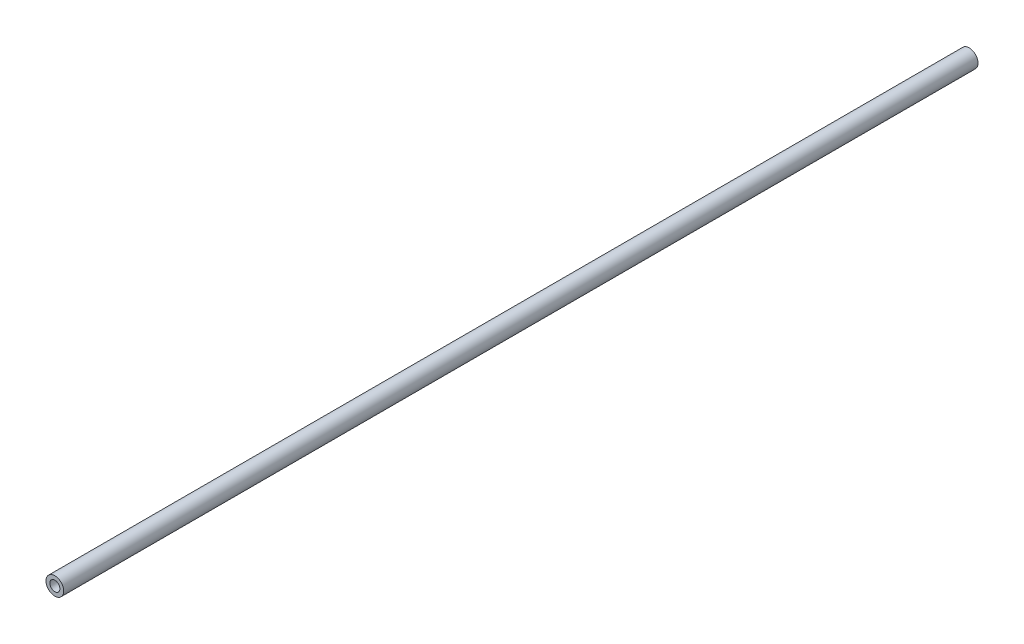
ISO-10303-21;
HEADER;
FILE_DESCRIPTION(('STEP AP214'),'2;1');
FILE_NAME('part.step','',(''),(''),'','','');
FILE_SCHEMA(('AUTOMOTIVE_DESIGN { 1 0 10303 214 1 1 1 1 }'));
ENDSEC;
DATA;
#1=APPLICATION_CONTEXT('core data for automotive mechanical design processes');
#2=APPLICATION_PROTOCOL_DEFINITION('international standard','automotive_design',2000,#1);
#3=PRODUCT_CONTEXT('',#1,'mechanical');
#4=PRODUCT('Part','Part','',(#3));
#5=PRODUCT_RELATED_PRODUCT_CATEGORY('part','',(#4));
#6=PRODUCT_DEFINITION_FORMATION('','',#4);
#7=PRODUCT_DEFINITION_CONTEXT('part definition',#1,'design');
#8=PRODUCT_DEFINITION('design','',#6,#7);
#9=PRODUCT_DEFINITION_SHAPE('','',#8);
#10=(LENGTH_UNIT() NAMED_UNIT(*) SI_UNIT(.MILLI.,.METRE.));
#11=(NAMED_UNIT(*) PLANE_ANGLE_UNIT() SI_UNIT($,.RADIAN.));
#12=(NAMED_UNIT(*) SI_UNIT($,.STERADIAN.) SOLID_ANGLE_UNIT());
#13=UNCERTAINTY_MEASURE_WITH_UNIT(LENGTH_MEASURE(1.E-05),#10,'distance_accuracy_value','');
#14=(GEOMETRIC_REPRESENTATION_CONTEXT(3) GLOBAL_UNCERTAINTY_ASSIGNED_CONTEXT((#13)) GLOBAL_UNIT_ASSIGNED_CONTEXT((#10,
#11,#12)) REPRESENTATION_CONTEXT('',''));
#15=CARTESIAN_POINT('',(0.,0.,0.));
#16=DIRECTION('',(0.,0.,1.));
#17=DIRECTION('',(1.,0.,0.));
#18=AXIS2_PLACEMENT_3D('',#15,#16,#17);
#19=CARTESIAN_POINT('',(0.,0.,620.));
#20=DIRECTION('',(0.,0.,-1.));
#21=DIRECTION('',(-1.,0.,0.));
#22=AXIS2_PLACEMENT_3D('',#19,#20,#21);
#23=CYLINDRICAL_SURFACE('',#22,6.);
#24=CARTESIAN_POINT('',(0.,0.,620.));
#25=DIRECTION('',(0.,0.,1.));
#26=DIRECTION('',(1.,0.,0.));
#27=AXIS2_PLACEMENT_3D('',#24,#25,#26);
#28=CIRCLE('',#27,6.);
#29=CARTESIAN_POINT('',(6.,0.,620.));
#30=VERTEX_POINT('',#29);
#31=EDGE_CURVE('E11',#30,#30,#28,.T.);
#32=ORIENTED_EDGE('',*,*,#31,.F.);
#33=EDGE_LOOP('',(#32));
#34=FACE_BOUND('',#33,.T.);
#35=CARTESIAN_POINT('',(0.,0.,0.));
#36=DIRECTION('',(0.,0.,1.));
#37=DIRECTION('',(1.,0.,0.));
#38=AXIS2_PLACEMENT_3D('',#35,#36,#37);
#39=CIRCLE('',#38,6.);
#40=CARTESIAN_POINT('',(6.,0.,0.));
#41=VERTEX_POINT('',#40);
#42=EDGE_CURVE('E38',#41,#41,#39,.T.);
#43=ORIENTED_EDGE('',*,*,#42,.T.);
#44=EDGE_LOOP('',(#43));
#45=FACE_BOUND('',#44,.T.);
#46=ADVANCED_FACE('F35',(#34,#45),#23,.T.);
#47=CARTESIAN_POINT('',(0.,0.,620.));
#48=DIRECTION('',(0.,0.,1.));
#49=DIRECTION('',(1.,0.,0.));
#50=AXIS2_PLACEMENT_3D('',#47,#48,#49);
#51=PLANE('',#50);
#52=CARTESIAN_POINT('',(0.,0.,620.));
#53=DIRECTION('',(0.,0.,1.));
#54=DIRECTION('',(1.,0.,0.));
#55=AXIS2_PLACEMENT_3D('',#52,#53,#54);
#56=CIRCLE('',#55,3.4);
#57=CARTESIAN_POINT('',(3.4,0.,620.));
#58=VERTEX_POINT('',#57);
#59=EDGE_CURVE('E58',#58,#58,#56,.T.);
#60=ORIENTED_EDGE('',*,*,#59,.F.);
#61=EDGE_LOOP('',(#60));
#62=FACE_BOUND('',#61,.T.);
#63=ORIENTED_EDGE('',*,*,#31,.T.);
#64=EDGE_LOOP('',(#63));
#65=FACE_BOUND('',#64,.T.);
#66=ADVANCED_FACE('F77',(#62,#65),#51,.T.);
#67=CARTESIAN_POINT('',(0.,0.,0.));
#68=DIRECTION('',(0.,0.,1.));
#69=DIRECTION('',(1.,0.,0.));
#70=AXIS2_PLACEMENT_3D('',#67,#68,#69);
#71=PLANE('',#70);
#72=CARTESIAN_POINT('',(0.,0.,0.));
#73=DIRECTION('',(0.,0.,-1.));
#74=DIRECTION('',(-1.,0.,0.));
#75=AXIS2_PLACEMENT_3D('',#72,#73,#74);
#76=CIRCLE('',#75,3.39999999999999);
#77=CARTESIAN_POINT('',(-3.39999999999999,0.,0.));
#78=VERTEX_POINT('',#77);
#79=EDGE_CURVE('E59',#78,#78,#76,.T.);
#80=ORIENTED_EDGE('',*,*,#79,.F.);
#81=EDGE_LOOP('',(#80));
#82=FACE_BOUND('',#81,.T.);
#83=ORIENTED_EDGE('',*,*,#42,.F.);
#84=EDGE_LOOP('',(#83));
#85=FACE_BOUND('',#84,.T.);
#86=ADVANCED_FACE('F74',(#82,#85),#71,.F.);
#87=CARTESIAN_POINT('',(0.,0.,590.));
#88=DIRECTION('',(0.,0.,1.));
#89=DIRECTION('',(1.,0.,0.));
#90=AXIS2_PLACEMENT_3D('',#87,#88,#89);
#91=CONICAL_SURFACE('',#90,3.39999999999999,1.02974425867665);
#92=CARTESIAN_POINT('',(0.,0.,587.957073895306));
#93=VERTEX_POINT('',#92);
#94=VERTEX_LOOP('',#93);
#95=FACE_BOUND('',#94,.T.);
#96=CARTESIAN_POINT('',(0.,0.,590.));
#97=DIRECTION('',(0.,0.,1.));
#98=DIRECTION('',(1.,0.,0.));
#99=AXIS2_PLACEMENT_3D('',#96,#97,#98);
#100=CIRCLE('',#99,3.39999999999999);
#101=CARTESIAN_POINT('',(3.39999999999999,0.,590.));
#102=VERTEX_POINT('',#101);
#103=EDGE_CURVE('E62',#102,#102,#100,.T.);
#104=ORIENTED_EDGE('',*,*,#103,.T.);
#105=EDGE_LOOP('',(#104));
#106=FACE_BOUND('',#105,.T.);
#107=ADVANCED_FACE('F76',(#95,#106),#91,.F.);
#108=CARTESIAN_POINT('',(0.,0.,620.));
#109=DIRECTION('',(0.,0.,1.));
#110=DIRECTION('',(1.,0.,0.));
#111=AXIS2_PLACEMENT_3D('',#108,#109,#110);
#112=CYLINDRICAL_SURFACE('',#111,3.4);
#113=ORIENTED_EDGE('',*,*,#103,.F.);
#114=EDGE_LOOP('',(#113));
#115=FACE_BOUND('',#114,.T.);
#116=ORIENTED_EDGE('',*,*,#59,.T.);
#117=EDGE_LOOP('',(#116));
#118=FACE_BOUND('',#117,.T.);
#119=ADVANCED_FACE('F52',(#115,#118),#112,.F.);
#120=CARTESIAN_POINT('',(0.,0.,30.));
#121=DIRECTION('',(0.,0.,-1.));
#122=DIRECTION('',(-1.,0.,0.));
#123=AXIS2_PLACEMENT_3D('',#120,#121,#122);
#124=CONICAL_SURFACE('',#123,3.39999999999999,1.02974425867665);
#125=CARTESIAN_POINT('',(0.,0.,32.0429261046937));
#126=VERTEX_POINT('',#125);
#127=VERTEX_LOOP('',#126);
#128=FACE_BOUND('',#127,.T.);
#129=CARTESIAN_POINT('',(0.,0.,30.));
#130=DIRECTION('',(0.,0.,-1.));
#131=DIRECTION('',(-1.,0.,0.));
#132=AXIS2_PLACEMENT_3D('',#129,#130,#131);
#133=CIRCLE('',#132,3.39999999999999);
#134=CARTESIAN_POINT('',(-3.39999999999999,0.,30.));
#135=VERTEX_POINT('',#134);
#136=EDGE_CURVE('E56',#135,#135,#133,.T.);
#137=ORIENTED_EDGE('',*,*,#136,.T.);
#138=EDGE_LOOP('',(#137));
#139=FACE_BOUND('',#138,.T.);
#140=ADVANCED_FACE('F48',(#128,#139),#124,.F.);
#141=CARTESIAN_POINT('',(0.,0.,0.));
#142=DIRECTION('',(0.,0.,-1.));
#143=DIRECTION('',(-1.,0.,0.));
#144=AXIS2_PLACEMENT_3D('',#141,#142,#143);
#145=CYLINDRICAL_SURFACE('',#144,3.39999999999999);
#146=ORIENTED_EDGE('',*,*,#136,.F.);
#147=EDGE_LOOP('',(#146));
#148=FACE_BOUND('',#147,.T.);
#149=ORIENTED_EDGE('',*,*,#79,.T.);
#150=EDGE_LOOP('',(#149));
#151=FACE_BOUND('',#150,.T.);
#152=ADVANCED_FACE('F51',(#148,#151),#145,.F.);
#153=CLOSED_SHELL('',(#46,#66,#86,#107,#119,#140,#152));
#154=MANIFOLD_SOLID_BREP('B2',#153);
#155=ADVANCED_BREP_SHAPE_REPRESENTATION('',(#18,#154),#14);
#156=SHAPE_DEFINITION_REPRESENTATION(#9,#155);
ENDSEC;
END-ISO-10303-21;
